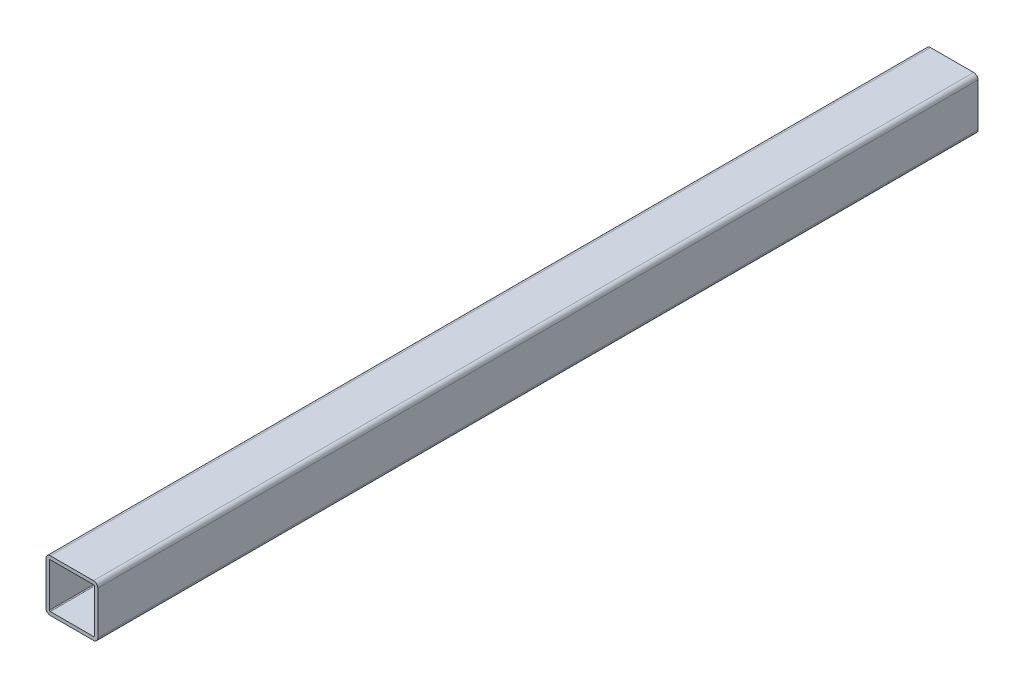
ISO-10303-21;
HEADER;
FILE_DESCRIPTION(('STEP AP214'),'2;1');
FILE_NAME('part.step','',(''),(''),'','','');
FILE_SCHEMA(('AUTOMOTIVE_DESIGN { 1 0 10303 214 1 1 1 1 }'));
ENDSEC;
DATA;
#1=APPLICATION_CONTEXT('core data for automotive mechanical design processes');
#2=APPLICATION_PROTOCOL_DEFINITION('international standard','automotive_design',2000,#1);
#3=PRODUCT_CONTEXT('',#1,'mechanical');
#4=PRODUCT('Part','Part','',(#3));
#5=PRODUCT_RELATED_PRODUCT_CATEGORY('part','',(#4));
#6=PRODUCT_DEFINITION_FORMATION('','',#4);
#7=PRODUCT_DEFINITION_CONTEXT('part definition',#1,'design');
#8=PRODUCT_DEFINITION('design','',#6,#7);
#9=PRODUCT_DEFINITION_SHAPE('','',#8);
#10=(LENGTH_UNIT() NAMED_UNIT(*) SI_UNIT(.MILLI.,.METRE.));
#11=(NAMED_UNIT(*) PLANE_ANGLE_UNIT() SI_UNIT($,.RADIAN.));
#12=(NAMED_UNIT(*) SI_UNIT($,.STERADIAN.) SOLID_ANGLE_UNIT());
#13=UNCERTAINTY_MEASURE_WITH_UNIT(LENGTH_MEASURE(1.E-05),#10,'distance_accuracy_value','');
#14=(GEOMETRIC_REPRESENTATION_CONTEXT(3) GLOBAL_UNCERTAINTY_ASSIGNED_CONTEXT((#13)) GLOBAL_UNIT_ASSIGNED_CONTEXT((#10,
#11,#12)) REPRESENTATION_CONTEXT('',''));
#15=CARTESIAN_POINT('',(0.,0.,0.));
#16=DIRECTION('',(0.,0.,1.));
#17=DIRECTION('',(1.,0.,0.));
#18=AXIS2_PLACEMENT_3D('',#15,#16,#17);
#19=CARTESIAN_POINT('',(-15.875,-15.875,323.85));
#20=DIRECTION('',(0.,0.,1.));
#21=DIRECTION('',(1.,0.,0.));
#22=AXIS2_PLACEMENT_3D('',#19,#20,#21);
#23=PLANE('',#22);
#24=CARTESIAN_POINT('',(-15.875,-15.875,323.85));
#25=DIRECTION('',(0.,0.,1.));
#26=DIRECTION('',(1.,0.,0.));
#27=AXIS2_PLACEMENT_3D('',#24,#25,#26);
#28=CIRCLE('',#27,3.175);
#29=CARTESIAN_POINT('',(-19.05,-15.875,323.85));
#30=VERTEX_POINT('',#29);
#31=CARTESIAN_POINT('',(-15.875,-19.05,323.85));
#32=VERTEX_POINT('',#31);
#33=EDGE_CURVE('E258',#30,#32,#28,.T.);
#34=ORIENTED_EDGE('',*,*,#33,.T.);
#35=DIRECTION('',(1.,0.,0.));
#36=VECTOR('',#35,1.);
#37=CARTESIAN_POINT('',(-15.875,-19.05,323.85));
#38=LINE('',#37,#36);
#39=CARTESIAN_POINT('',(15.875,-19.05,323.85));
#40=VERTEX_POINT('',#39);
#41=EDGE_CURVE('E261',#32,#40,#38,.T.);
#42=ORIENTED_EDGE('',*,*,#41,.T.);
#43=CARTESIAN_POINT('',(15.875,-15.875,323.85));
#44=DIRECTION('',(0.,0.,1.));
#45=DIRECTION('',(1.,0.,0.));
#46=AXIS2_PLACEMENT_3D('',#43,#44,#45);
#47=CIRCLE('',#46,3.175);
#48=CARTESIAN_POINT('',(19.05,-15.875,323.85));
#49=VERTEX_POINT('',#48);
#50=EDGE_CURVE('E264',#40,#49,#47,.T.);
#51=ORIENTED_EDGE('',*,*,#50,.T.);
#52=DIRECTION('',(0.,1.,0.));
#53=VECTOR('',#52,1.);
#54=CARTESIAN_POINT('',(19.05,15.875,323.85));
#55=LINE('',#54,#53);
#56=CARTESIAN_POINT('',(19.05,15.875,323.85));
#57=VERTEX_POINT('',#56);
#58=EDGE_CURVE('E266',#49,#57,#55,.T.);
#59=ORIENTED_EDGE('',*,*,#58,.T.);
#60=CARTESIAN_POINT('',(15.875,15.875,323.85));
#61=DIRECTION('',(0.,0.,1.));
#62=DIRECTION('',(1.,0.,0.));
#63=AXIS2_PLACEMENT_3D('',#60,#61,#62);
#64=CIRCLE('',#63,3.175);
#65=CARTESIAN_POINT('',(15.875,19.05,323.85));
#66=VERTEX_POINT('',#65);
#67=EDGE_CURVE('E268',#57,#66,#64,.T.);
#68=ORIENTED_EDGE('',*,*,#67,.T.);
#69=DIRECTION('',(-1.,0.,0.));
#70=VECTOR('',#69,1.);
#71=CARTESIAN_POINT('',(-15.875,19.05,323.85));
#72=LINE('',#71,#70);
#73=CARTESIAN_POINT('',(-15.875,19.05,323.85));
#74=VERTEX_POINT('',#73);
#75=EDGE_CURVE('E270',#66,#74,#72,.T.);
#76=ORIENTED_EDGE('',*,*,#75,.T.);
#77=CARTESIAN_POINT('',(-15.875,15.875,323.85));
#78=DIRECTION('',(0.,0.,1.));
#79=DIRECTION('',(1.,0.,0.));
#80=AXIS2_PLACEMENT_3D('',#77,#78,#79);
#81=CIRCLE('',#80,3.175);
#82=CARTESIAN_POINT('',(-19.05,15.875,323.85));
#83=VERTEX_POINT('',#82);
#84=EDGE_CURVE('E272',#74,#83,#81,.T.);
#85=ORIENTED_EDGE('',*,*,#84,.T.);
#86=DIRECTION('',(0.,-1.,0.));
#87=VECTOR('',#86,1.);
#88=CARTESIAN_POINT('',(-19.05,15.875,323.85));
#89=LINE('',#88,#87);
#90=EDGE_CURVE('E274',#83,#30,#89,.T.);
#91=ORIENTED_EDGE('',*,*,#90,.T.);
#92=EDGE_LOOP('',(#34,#42,#51,#59,#68,#76,#85,#91));
#93=FACE_BOUND('',#92,.T.);
#94=DIRECTION('',(1.,0.,0.));
#95=VECTOR('',#94,1.);
#96=CARTESIAN_POINT('',(-15.875,-16.51,323.85));
#97=LINE('',#96,#95);
#98=CARTESIAN_POINT('',(-15.875,-16.51,323.85));
#99=VERTEX_POINT('',#98);
#100=CARTESIAN_POINT('',(15.875,-16.51,323.85));
#101=VERTEX_POINT('',#100);
#102=EDGE_CURVE('E201',#99,#101,#97,.T.);
#103=ORIENTED_EDGE('',*,*,#102,.F.);
#104=CARTESIAN_POINT('',(-15.875,-15.875,323.85));
#105=DIRECTION('',(0.,0.,1.));
#106=DIRECTION('',(1.,0.,0.));
#107=AXIS2_PLACEMENT_3D('',#104,#105,#106);
#108=CIRCLE('',#107,0.635000000000002);
#109=CARTESIAN_POINT('',(-16.51,-15.875,323.85));
#110=VERTEX_POINT('',#109);
#111=EDGE_CURVE('E193',#110,#99,#108,.T.);
#112=ORIENTED_EDGE('',*,*,#111,.F.);
#113=DIRECTION('',(0.,-1.,0.));
#114=VECTOR('',#113,1.);
#115=CARTESIAN_POINT('',(-16.51,15.875,323.85));
#116=LINE('',#115,#114);
#117=CARTESIAN_POINT('',(-16.51,15.875,323.85));
#118=VERTEX_POINT('',#117);
#119=EDGE_CURVE('E226',#118,#110,#116,.T.);
#120=ORIENTED_EDGE('',*,*,#119,.F.);
#121=CARTESIAN_POINT('',(-15.875,15.875,323.85));
#122=DIRECTION('',(0.,0.,1.));
#123=DIRECTION('',(1.,0.,0.));
#124=AXIS2_PLACEMENT_3D('',#121,#122,#123);
#125=CIRCLE('',#124,0.635000000000004);
#126=CARTESIAN_POINT('',(-15.875,16.51,323.85));
#127=VERTEX_POINT('',#126);
#128=EDGE_CURVE('E224',#127,#118,#125,.T.);
#129=ORIENTED_EDGE('',*,*,#128,.F.);
#130=DIRECTION('',(-1.,0.,0.));
#131=VECTOR('',#130,1.);
#132=CARTESIAN_POINT('',(-15.875,16.51,323.85));
#133=LINE('',#132,#131);
#134=CARTESIAN_POINT('',(15.875,16.51,323.85));
#135=VERTEX_POINT('',#134);
#136=EDGE_CURVE('E222',#135,#127,#133,.T.);
#137=ORIENTED_EDGE('',*,*,#136,.F.);
#138=CARTESIAN_POINT('',(15.875,15.875,323.85));
#139=DIRECTION('',(0.,0.,1.));
#140=DIRECTION('',(1.,0.,0.));
#141=AXIS2_PLACEMENT_3D('',#138,#139,#140);
#142=CIRCLE('',#141,0.635000000000004);
#143=CARTESIAN_POINT('',(16.51,15.875,323.85));
#144=VERTEX_POINT('',#143);
#145=EDGE_CURVE('E220',#144,#135,#142,.T.);
#146=ORIENTED_EDGE('',*,*,#145,.F.);
#147=DIRECTION('',(0.,1.,0.));
#148=VECTOR('',#147,1.);
#149=CARTESIAN_POINT('',(16.51,15.875,323.85));
#150=LINE('',#149,#148);
#151=CARTESIAN_POINT('',(16.51,-15.875,323.85));
#152=VERTEX_POINT('',#151);
#153=EDGE_CURVE('E216',#152,#144,#150,.T.);
#154=ORIENTED_EDGE('',*,*,#153,.F.);
#155=CARTESIAN_POINT('',(15.875,-15.875,323.85));
#156=DIRECTION('',(0.,0.,1.));
#157=DIRECTION('',(1.,0.,0.));
#158=AXIS2_PLACEMENT_3D('',#155,#156,#157);
#159=CIRCLE('',#158,0.634999999999999);
#160=EDGE_CURVE('E214',#101,#152,#159,.T.);
#161=ORIENTED_EDGE('',*,*,#160,.F.);
#162=EDGE_LOOP('',(#103,#112,#120,#129,#137,#146,#154,#161));
#163=FACE_BOUND('',#162,.T.);
#164=ADVANCED_FACE('F80',(#93,#163),#23,.T.);
#165=CARTESIAN_POINT('',(-15.875,-15.875,-323.85));
#166=DIRECTION('',(0.,0.,1.));
#167=DIRECTION('',(1.,0.,0.));
#168=AXIS2_PLACEMENT_3D('',#165,#166,#167);
#169=PLANE('',#168);
#170=CARTESIAN_POINT('',(-15.875,-15.875,-323.85));
#171=DIRECTION('',(0.,0.,1.));
#172=DIRECTION('',(1.,0.,0.));
#173=AXIS2_PLACEMENT_3D('',#170,#171,#172);
#174=CIRCLE('',#173,3.175);
#175=CARTESIAN_POINT('',(-19.05,-15.875,-323.85));
#176=VERTEX_POINT('',#175);
#177=CARTESIAN_POINT('',(-15.875,-19.05,-323.85));
#178=VERTEX_POINT('',#177);
#179=EDGE_CURVE('E209',#176,#178,#174,.T.);
#180=ORIENTED_EDGE('',*,*,#179,.F.);
#181=DIRECTION('',(0.,-1.,0.));
#182=VECTOR('',#181,1.);
#183=CARTESIAN_POINT('',(-19.05,15.875,-323.85));
#184=LINE('',#183,#182);
#185=CARTESIAN_POINT('',(-19.05,15.875,-323.85));
#186=VERTEX_POINT('',#185);
#187=EDGE_CURVE('E262',#186,#176,#184,.T.);
#188=ORIENTED_EDGE('',*,*,#187,.F.);
#189=CARTESIAN_POINT('',(-15.875,15.875,-323.85));
#190=DIRECTION('',(0.,0.,1.));
#191=DIRECTION('',(1.,0.,0.));
#192=AXIS2_PLACEMENT_3D('',#189,#190,#191);
#193=CIRCLE('',#192,3.175);
#194=CARTESIAN_POINT('',(-15.875,19.05,-323.85));
#195=VERTEX_POINT('',#194);
#196=EDGE_CURVE('E289',#195,#186,#193,.T.);
#197=ORIENTED_EDGE('',*,*,#196,.F.);
#198=DIRECTION('',(-1.,0.,0.));
#199=VECTOR('',#198,1.);
#200=CARTESIAN_POINT('',(-15.875,19.05,-323.85));
#201=LINE('',#200,#199);
#202=CARTESIAN_POINT('',(15.875,19.05,-323.85));
#203=VERTEX_POINT('',#202);
#204=EDGE_CURVE('E287',#203,#195,#201,.T.);
#205=ORIENTED_EDGE('',*,*,#204,.F.);
#206=CARTESIAN_POINT('',(15.875,15.875,-323.85));
#207=DIRECTION('',(0.,0.,1.));
#208=DIRECTION('',(1.,0.,0.));
#209=AXIS2_PLACEMENT_3D('',#206,#207,#208);
#210=CIRCLE('',#209,3.175);
#211=CARTESIAN_POINT('',(19.05,15.875,-323.85));
#212=VERTEX_POINT('',#211);
#213=EDGE_CURVE('E285',#212,#203,#210,.T.);
#214=ORIENTED_EDGE('',*,*,#213,.F.);
#215=DIRECTION('',(0.,1.,0.));
#216=VECTOR('',#215,1.);
#217=CARTESIAN_POINT('',(19.05,15.875,-323.85));
#218=LINE('',#217,#216);
#219=CARTESIAN_POINT('',(19.05,-15.875,-323.85));
#220=VERTEX_POINT('',#219);
#221=EDGE_CURVE('E283',#220,#212,#218,.T.);
#222=ORIENTED_EDGE('',*,*,#221,.F.);
#223=CARTESIAN_POINT('',(15.875,-15.875,-323.85));
#224=DIRECTION('',(0.,0.,1.));
#225=DIRECTION('',(1.,0.,0.));
#226=AXIS2_PLACEMENT_3D('',#223,#224,#225);
#227=CIRCLE('',#226,3.175);
#228=CARTESIAN_POINT('',(15.875,-19.05,-323.85));
#229=VERTEX_POINT('',#228);
#230=EDGE_CURVE('E281',#229,#220,#227,.T.);
#231=ORIENTED_EDGE('',*,*,#230,.F.);
#232=DIRECTION('',(1.,0.,0.));
#233=VECTOR('',#232,1.);
#234=CARTESIAN_POINT('',(-15.875,-19.05,-323.85));
#235=LINE('',#234,#233);
#236=EDGE_CURVE('E279',#178,#229,#235,.T.);
#237=ORIENTED_EDGE('',*,*,#236,.F.);
#238=EDGE_LOOP('',(#180,#188,#197,#205,#214,#222,#231,#237));
#239=FACE_BOUND('',#238,.T.);
#240=CARTESIAN_POINT('',(-15.875,-15.875,-323.85));
#241=DIRECTION('',(0.,0.,1.));
#242=DIRECTION('',(1.,0.,0.));
#243=AXIS2_PLACEMENT_3D('',#240,#241,#242);
#244=CIRCLE('',#243,0.635000000000002);
#245=CARTESIAN_POINT('',(-16.51,-15.875,-323.85));
#246=VERTEX_POINT('',#245);
#247=CARTESIAN_POINT('',(-15.875,-16.51,-323.85));
#248=VERTEX_POINT('',#247);
#249=EDGE_CURVE('E103',#246,#248,#244,.T.);
#250=ORIENTED_EDGE('',*,*,#249,.T.);
#251=DIRECTION('',(1.,0.,0.));
#252=VECTOR('',#251,1.);
#253=CARTESIAN_POINT('',(-15.875,-16.51,-323.85));
#254=LINE('',#253,#252);
#255=CARTESIAN_POINT('',(15.875,-16.51,-323.85));
#256=VERTEX_POINT('',#255);
#257=EDGE_CURVE('E208',#248,#256,#254,.T.);
#258=ORIENTED_EDGE('',*,*,#257,.T.);
#259=CARTESIAN_POINT('',(15.875,-15.875,-323.85));
#260=DIRECTION('',(0.,0.,1.));
#261=DIRECTION('',(1.,0.,0.));
#262=AXIS2_PLACEMENT_3D('',#259,#260,#261);
#263=CIRCLE('',#262,0.634999999999999);
#264=CARTESIAN_POINT('',(16.51,-15.875,-323.85));
#265=VERTEX_POINT('',#264);
#266=EDGE_CURVE('E230',#256,#265,#263,.T.);
#267=ORIENTED_EDGE('',*,*,#266,.T.);
#268=DIRECTION('',(0.,1.,0.));
#269=VECTOR('',#268,1.);
#270=CARTESIAN_POINT('',(16.51,15.875,-323.85));
#271=LINE('',#270,#269);
#272=CARTESIAN_POINT('',(16.51,15.875,-323.85));
#273=VERTEX_POINT('',#272);
#274=EDGE_CURVE('E233',#265,#273,#271,.T.);
#275=ORIENTED_EDGE('',*,*,#274,.T.);
#276=CARTESIAN_POINT('',(15.875,15.875,-323.85));
#277=DIRECTION('',(0.,0.,1.));
#278=DIRECTION('',(1.,0.,0.));
#279=AXIS2_PLACEMENT_3D('',#276,#277,#278);
#280=CIRCLE('',#279,0.635000000000004);
#281=CARTESIAN_POINT('',(15.875,16.51,-323.85));
#282=VERTEX_POINT('',#281);
#283=EDGE_CURVE('E236',#273,#282,#280,.T.);
#284=ORIENTED_EDGE('',*,*,#283,.T.);
#285=DIRECTION('',(-1.,0.,0.));
#286=VECTOR('',#285,1.);
#287=CARTESIAN_POINT('',(-15.875,16.51,-323.85));
#288=LINE('',#287,#286);
#289=CARTESIAN_POINT('',(-15.875,16.51,-323.85));
#290=VERTEX_POINT('',#289);
#291=EDGE_CURVE('E239',#282,#290,#288,.T.);
#292=ORIENTED_EDGE('',*,*,#291,.T.);
#293=CARTESIAN_POINT('',(-15.875,15.875,-323.85));
#294=DIRECTION('',(0.,0.,1.));
#295=DIRECTION('',(1.,0.,0.));
#296=AXIS2_PLACEMENT_3D('',#293,#294,#295);
#297=CIRCLE('',#296,0.635000000000004);
#298=CARTESIAN_POINT('',(-16.51,15.875,-323.85));
#299=VERTEX_POINT('',#298);
#300=EDGE_CURVE('E242',#290,#299,#297,.T.);
#301=ORIENTED_EDGE('',*,*,#300,.T.);
#302=DIRECTION('',(0.,-1.,0.));
#303=VECTOR('',#302,1.);
#304=CARTESIAN_POINT('',(-16.51,15.875,-323.85));
#305=LINE('',#304,#303);
#306=EDGE_CURVE('E202',#299,#246,#305,.T.);
#307=ORIENTED_EDGE('',*,*,#306,.T.);
#308=EDGE_LOOP('',(#250,#258,#267,#275,#284,#292,#301,#307));
#309=FACE_BOUND('',#308,.T.);
#310=ADVANCED_FACE('F319',(#239,#309),#169,.F.);
#311=CARTESIAN_POINT('',(-15.875,-15.875,323.85));
#312=DIRECTION('',(0.,0.,-1.));
#313=DIRECTION('',(-1.,0.,0.));
#314=AXIS2_PLACEMENT_3D('',#311,#312,#313);
#315=CYLINDRICAL_SURFACE('',#314,3.175);
#316=ORIENTED_EDGE('',*,*,#179,.T.);
#317=DIRECTION('',(0.,0.,-1.));
#318=VECTOR('',#317,1.);
#319=CARTESIAN_POINT('',(-15.875,-19.05,323.85));
#320=LINE('',#319,#318);
#321=EDGE_CURVE('E12',#32,#178,#320,.T.);
#322=ORIENTED_EDGE('',*,*,#321,.F.);
#323=ORIENTED_EDGE('',*,*,#33,.F.);
#324=DIRECTION('',(0.,0.,-1.));
#325=VECTOR('',#324,1.);
#326=CARTESIAN_POINT('',(-19.05,-15.875,323.85));
#327=LINE('',#326,#325);
#328=EDGE_CURVE('E276',#30,#176,#327,.T.);
#329=ORIENTED_EDGE('',*,*,#328,.T.);
#330=EDGE_LOOP('',(#316,#322,#323,#329));
#331=FACE_BOUND('',#330,.T.);
#332=ADVANCED_FACE('F82',(#331),#315,.T.);
#333=CARTESIAN_POINT('',(-15.875,-19.05,323.85));
#334=DIRECTION('',(0.,1.,0.));
#335=DIRECTION('',(0.,0.,1.));
#336=AXIS2_PLACEMENT_3D('',#333,#334,#335);
#337=PLANE('',#336);
#338=ORIENTED_EDGE('',*,*,#236,.T.);
#339=DIRECTION('',(0.,0.,-1.));
#340=VECTOR('',#339,1.);
#341=CARTESIAN_POINT('',(15.875,-19.05,323.85));
#342=LINE('',#341,#340);
#343=EDGE_CURVE('E88',#40,#229,#342,.T.);
#344=ORIENTED_EDGE('',*,*,#343,.F.);
#345=ORIENTED_EDGE('',*,*,#41,.F.);
#346=ORIENTED_EDGE('',*,*,#321,.T.);
#347=EDGE_LOOP('',(#338,#344,#345,#346));
#348=FACE_BOUND('',#347,.T.);
#349=ADVANCED_FACE('F336',(#348),#337,.F.);
#350=CARTESIAN_POINT('',(15.875,-15.875,323.85));
#351=DIRECTION('',(0.,0.,-1.));
#352=DIRECTION('',(-1.,0.,0.));
#353=AXIS2_PLACEMENT_3D('',#350,#351,#352);
#354=CYLINDRICAL_SURFACE('',#353,3.175);
#355=ORIENTED_EDGE('',*,*,#230,.T.);
#356=DIRECTION('',(0.,0.,-1.));
#357=VECTOR('',#356,1.);
#358=CARTESIAN_POINT('',(19.05,-15.875,323.85));
#359=LINE('',#358,#357);
#360=EDGE_CURVE('E306',#49,#220,#359,.T.);
#361=ORIENTED_EDGE('',*,*,#360,.F.);
#362=ORIENTED_EDGE('',*,*,#50,.F.);
#363=ORIENTED_EDGE('',*,*,#343,.T.);
#364=EDGE_LOOP('',(#355,#361,#362,#363));
#365=FACE_BOUND('',#364,.T.);
#366=ADVANCED_FACE('F313',(#365),#354,.T.);
#367=CARTESIAN_POINT('',(19.05,15.875,323.85));
#368=DIRECTION('',(-1.,0.,0.));
#369=DIRECTION('',(0.,-1.,0.));
#370=AXIS2_PLACEMENT_3D('',#367,#368,#369);
#371=PLANE('',#370);
#372=ORIENTED_EDGE('',*,*,#221,.T.);
#373=DIRECTION('',(0.,0.,-1.));
#374=VECTOR('',#373,1.);
#375=CARTESIAN_POINT('',(19.05,15.875,323.85));
#376=LINE('',#375,#374);
#377=EDGE_CURVE('E303',#57,#212,#376,.T.);
#378=ORIENTED_EDGE('',*,*,#377,.F.);
#379=ORIENTED_EDGE('',*,*,#58,.F.);
#380=ORIENTED_EDGE('',*,*,#360,.T.);
#381=EDGE_LOOP('',(#372,#378,#379,#380));
#382=FACE_BOUND('',#381,.T.);
#383=ADVANCED_FACE('F325',(#382),#371,.F.);
#384=CARTESIAN_POINT('',(15.875,15.875,323.85));
#385=DIRECTION('',(0.,0.,-1.));
#386=DIRECTION('',(-1.,0.,0.));
#387=AXIS2_PLACEMENT_3D('',#384,#385,#386);
#388=CYLINDRICAL_SURFACE('',#387,3.175);
#389=ORIENTED_EDGE('',*,*,#213,.T.);
#390=DIRECTION('',(0.,0.,-1.));
#391=VECTOR('',#390,1.);
#392=CARTESIAN_POINT('',(15.875,19.05,323.85));
#393=LINE('',#392,#391);
#394=EDGE_CURVE('E300',#66,#203,#393,.T.);
#395=ORIENTED_EDGE('',*,*,#394,.F.);
#396=ORIENTED_EDGE('',*,*,#67,.F.);
#397=ORIENTED_EDGE('',*,*,#377,.T.);
#398=EDGE_LOOP('',(#389,#395,#396,#397));
#399=FACE_BOUND('',#398,.T.);
#400=ADVANCED_FACE('F329',(#399),#388,.T.);
#401=CARTESIAN_POINT('',(-15.875,19.05,323.85));
#402=DIRECTION('',(0.,-1.,0.));
#403=DIRECTION('',(0.,0.,-1.));
#404=AXIS2_PLACEMENT_3D('',#401,#402,#403);
#405=PLANE('',#404);
#406=ORIENTED_EDGE('',*,*,#204,.T.);
#407=DIRECTION('',(0.,0.,-1.));
#408=VECTOR('',#407,1.);
#409=CARTESIAN_POINT('',(-15.875,19.05,323.85));
#410=LINE('',#409,#408);
#411=EDGE_CURVE('E297',#74,#195,#410,.T.);
#412=ORIENTED_EDGE('',*,*,#411,.F.);
#413=ORIENTED_EDGE('',*,*,#75,.F.);
#414=ORIENTED_EDGE('',*,*,#394,.T.);
#415=EDGE_LOOP('',(#406,#412,#413,#414));
#416=FACE_BOUND('',#415,.T.);
#417=ADVANCED_FACE('F349',(#416),#405,.F.);
#418=CARTESIAN_POINT('',(-15.875,15.875,323.85));
#419=DIRECTION('',(0.,0.,-1.));
#420=DIRECTION('',(-1.,0.,0.));
#421=AXIS2_PLACEMENT_3D('',#418,#419,#420);
#422=CYLINDRICAL_SURFACE('',#421,3.175);
#423=ORIENTED_EDGE('',*,*,#196,.T.);
#424=DIRECTION('',(0.,0.,-1.));
#425=VECTOR('',#424,1.);
#426=CARTESIAN_POINT('',(-19.05,15.875,323.85));
#427=LINE('',#426,#425);
#428=EDGE_CURVE('E294',#83,#186,#427,.T.);
#429=ORIENTED_EDGE('',*,*,#428,.F.);
#430=ORIENTED_EDGE('',*,*,#84,.F.);
#431=ORIENTED_EDGE('',*,*,#411,.T.);
#432=EDGE_LOOP('',(#423,#429,#430,#431));
#433=FACE_BOUND('',#432,.T.);
#434=ADVANCED_FACE('F347',(#433),#422,.T.);
#435=CARTESIAN_POINT('',(-19.05,15.875,323.85));
#436=DIRECTION('',(1.,0.,0.));
#437=DIRECTION('',(0.,1.,0.));
#438=AXIS2_PLACEMENT_3D('',#435,#436,#437);
#439=PLANE('',#438);
#440=ORIENTED_EDGE('',*,*,#187,.T.);
#441=ORIENTED_EDGE('',*,*,#328,.F.);
#442=ORIENTED_EDGE('',*,*,#90,.F.);
#443=ORIENTED_EDGE('',*,*,#428,.T.);
#444=EDGE_LOOP('',(#440,#441,#442,#443));
#445=FACE_BOUND('',#444,.T.);
#446=ADVANCED_FACE('F342',(#445),#439,.F.);
#447=CARTESIAN_POINT('',(-15.875,-15.875,323.85));
#448=DIRECTION('',(0.,0.,-1.));
#449=DIRECTION('',(-1.,0.,0.));
#450=AXIS2_PLACEMENT_3D('',#447,#448,#449);
#451=CYLINDRICAL_SURFACE('',#450,0.635000000000002);
#452=ORIENTED_EDGE('',*,*,#249,.F.);
#453=DIRECTION('',(0.,0.,-1.));
#454=VECTOR('',#453,1.);
#455=CARTESIAN_POINT('',(-16.51,-15.875,323.85));
#456=LINE('',#455,#454);
#457=EDGE_CURVE('E197',#110,#246,#456,.T.);
#458=ORIENTED_EDGE('',*,*,#457,.F.);
#459=ORIENTED_EDGE('',*,*,#111,.T.);
#460=DIRECTION('',(0.,0.,-1.));
#461=VECTOR('',#460,1.);
#462=CARTESIAN_POINT('',(-15.875,-16.51,323.85));
#463=LINE('',#462,#461);
#464=EDGE_CURVE('E196',#99,#248,#463,.T.);
#465=ORIENTED_EDGE('',*,*,#464,.T.);
#466=EDGE_LOOP('',(#452,#458,#459,#465));
#467=FACE_BOUND('',#466,.T.);
#468=ADVANCED_FACE('F195',(#467),#451,.F.);
#469=CARTESIAN_POINT('',(-15.875,-16.51,323.85));
#470=DIRECTION('',(0.,1.,0.));
#471=DIRECTION('',(0.,0.,1.));
#472=AXIS2_PLACEMENT_3D('',#469,#470,#471);
#473=PLANE('',#472);
#474=ORIENTED_EDGE('',*,*,#257,.F.);
#475=ORIENTED_EDGE('',*,*,#464,.F.);
#476=ORIENTED_EDGE('',*,*,#102,.T.);
#477=DIRECTION('',(0.,0.,-1.));
#478=VECTOR('',#477,1.);
#479=CARTESIAN_POINT('',(15.875,-16.51,323.85));
#480=LINE('',#479,#478);
#481=EDGE_CURVE('E210',#101,#256,#480,.T.);
#482=ORIENTED_EDGE('',*,*,#481,.T.);
#483=EDGE_LOOP('',(#474,#475,#476,#482));
#484=FACE_BOUND('',#483,.T.);
#485=ADVANCED_FACE('F205',(#484),#473,.T.);
#486=CARTESIAN_POINT('',(15.875,-15.875,323.85));
#487=DIRECTION('',(0.,0.,-1.));
#488=DIRECTION('',(-1.,0.,0.));
#489=AXIS2_PLACEMENT_3D('',#486,#487,#488);
#490=CYLINDRICAL_SURFACE('',#489,0.634999999999999);
#491=ORIENTED_EDGE('',*,*,#266,.F.);
#492=ORIENTED_EDGE('',*,*,#481,.F.);
#493=ORIENTED_EDGE('',*,*,#160,.T.);
#494=DIRECTION('',(0.,0.,-1.));
#495=VECTOR('',#494,1.);
#496=CARTESIAN_POINT('',(16.51,-15.875,323.85));
#497=LINE('',#496,#495);
#498=EDGE_CURVE('E255',#152,#265,#497,.T.);
#499=ORIENTED_EDGE('',*,*,#498,.T.);
#500=EDGE_LOOP('',(#491,#492,#493,#499));
#501=FACE_BOUND('',#500,.T.);
#502=ADVANCED_FACE('F374',(#501),#490,.F.);
#503=CARTESIAN_POINT('',(16.51,15.875,323.85));
#504=DIRECTION('',(-1.,0.,0.));
#505=DIRECTION('',(0.,-1.,0.));
#506=AXIS2_PLACEMENT_3D('',#503,#504,#505);
#507=PLANE('',#506);
#508=ORIENTED_EDGE('',*,*,#274,.F.);
#509=ORIENTED_EDGE('',*,*,#498,.F.);
#510=ORIENTED_EDGE('',*,*,#153,.T.);
#511=DIRECTION('',(0.,0.,-1.));
#512=VECTOR('',#511,1.);
#513=CARTESIAN_POINT('',(16.51,15.875,323.85));
#514=LINE('',#513,#512);
#515=EDGE_CURVE('E253',#144,#273,#514,.T.);
#516=ORIENTED_EDGE('',*,*,#515,.T.);
#517=EDGE_LOOP('',(#508,#509,#510,#516));
#518=FACE_BOUND('',#517,.T.);
#519=ADVANCED_FACE('F378',(#518),#507,.T.);
#520=CARTESIAN_POINT('',(15.875,15.875,323.85));
#521=DIRECTION('',(0.,0.,-1.));
#522=DIRECTION('',(-1.,0.,0.));
#523=AXIS2_PLACEMENT_3D('',#520,#521,#522);
#524=CYLINDRICAL_SURFACE('',#523,0.635000000000004);
#525=ORIENTED_EDGE('',*,*,#283,.F.);
#526=ORIENTED_EDGE('',*,*,#515,.F.);
#527=ORIENTED_EDGE('',*,*,#145,.T.);
#528=DIRECTION('',(0.,0.,-1.));
#529=VECTOR('',#528,1.);
#530=CARTESIAN_POINT('',(15.875,16.51,323.85));
#531=LINE('',#530,#529);
#532=EDGE_CURVE('E251',#135,#282,#531,.T.);
#533=ORIENTED_EDGE('',*,*,#532,.T.);
#534=EDGE_LOOP('',(#525,#526,#527,#533));
#535=FACE_BOUND('',#534,.T.);
#536=ADVANCED_FACE('F384',(#535),#524,.F.);
#537=CARTESIAN_POINT('',(-15.875,16.51,323.85));
#538=DIRECTION('',(0.,-1.,0.));
#539=DIRECTION('',(0.,0.,-1.));
#540=AXIS2_PLACEMENT_3D('',#537,#538,#539);
#541=PLANE('',#540);
#542=ORIENTED_EDGE('',*,*,#291,.F.);
#543=ORIENTED_EDGE('',*,*,#532,.F.);
#544=ORIENTED_EDGE('',*,*,#136,.T.);
#545=DIRECTION('',(0.,0.,-1.));
#546=VECTOR('',#545,1.);
#547=CARTESIAN_POINT('',(-15.875,16.51,323.85));
#548=LINE('',#547,#546);
#549=EDGE_CURVE('E249',#127,#290,#548,.T.);
#550=ORIENTED_EDGE('',*,*,#549,.T.);
#551=EDGE_LOOP('',(#542,#543,#544,#550));
#552=FACE_BOUND('',#551,.T.);
#553=ADVANCED_FACE('F388',(#552),#541,.T.);
#554=CARTESIAN_POINT('',(-15.875,15.875,323.85));
#555=DIRECTION('',(0.,0.,-1.));
#556=DIRECTION('',(-1.,0.,0.));
#557=AXIS2_PLACEMENT_3D('',#554,#555,#556);
#558=CYLINDRICAL_SURFACE('',#557,0.635000000000004);
#559=ORIENTED_EDGE('',*,*,#300,.F.);
#560=ORIENTED_EDGE('',*,*,#549,.F.);
#561=ORIENTED_EDGE('',*,*,#128,.T.);
#562=DIRECTION('',(0.,0.,-1.));
#563=VECTOR('',#562,1.);
#564=CARTESIAN_POINT('',(-16.51,15.875,323.85));
#565=LINE('',#564,#563);
#566=EDGE_CURVE('E95',#118,#299,#565,.T.);
#567=ORIENTED_EDGE('',*,*,#566,.T.);
#568=EDGE_LOOP('',(#559,#560,#561,#567));
#569=FACE_BOUND('',#568,.T.);
#570=ADVANCED_FACE('F392',(#569),#558,.F.);
#571=CARTESIAN_POINT('',(-16.51,15.875,323.85));
#572=DIRECTION('',(1.,0.,0.));
#573=DIRECTION('',(0.,1.,0.));
#574=AXIS2_PLACEMENT_3D('',#571,#572,#573);
#575=PLANE('',#574);
#576=ORIENTED_EDGE('',*,*,#306,.F.);
#577=ORIENTED_EDGE('',*,*,#566,.F.);
#578=ORIENTED_EDGE('',*,*,#119,.T.);
#579=ORIENTED_EDGE('',*,*,#457,.T.);
#580=EDGE_LOOP('',(#576,#577,#578,#579));
#581=FACE_BOUND('',#580,.T.);
#582=ADVANCED_FACE('F396',(#581),#575,.T.);
#583=CLOSED_SHELL('',(#164,#310,#332,#349,#366,#383,#400,#417,#434,#446,#468,#485,#502,#519,
#536,#553,#570,#582));
#584=MANIFOLD_SOLID_BREP('B2',#583);
#585=ADVANCED_BREP_SHAPE_REPRESENTATION('',(#18,#584),#14);
#586=SHAPE_DEFINITION_REPRESENTATION(#9,#585);
ENDSEC;
END-ISO-10303-21;
